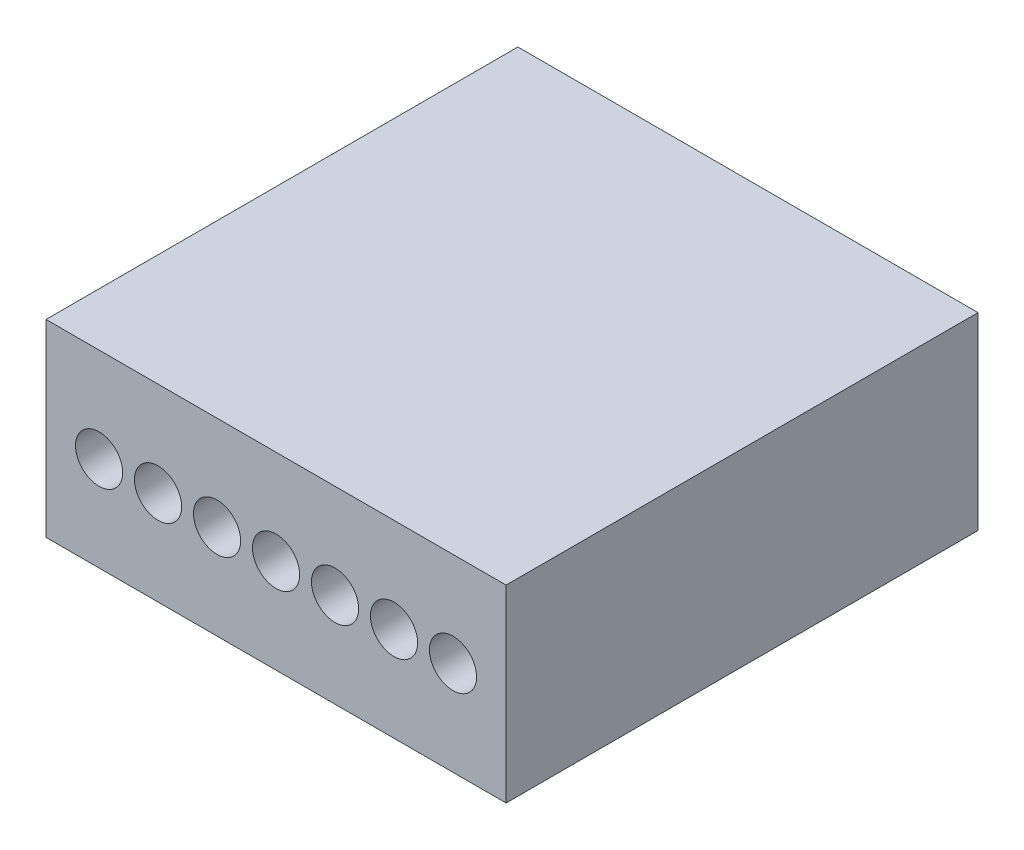
ISO-10303-21;
HEADER;
FILE_DESCRIPTION(('STEP AP214'),'2;1');
FILE_NAME('part.step','',(''),(''),'','','');
FILE_SCHEMA(('AUTOMOTIVE_DESIGN { 1 0 10303 214 1 1 1 1 }'));
ENDSEC;
DATA;
#1=APPLICATION_CONTEXT('core data for automotive mechanical design processes');
#2=APPLICATION_PROTOCOL_DEFINITION('international standard','automotive_design',2000,#1);
#3=PRODUCT_CONTEXT('',#1,'mechanical');
#4=PRODUCT('Part','Part','',(#3));
#5=PRODUCT_RELATED_PRODUCT_CATEGORY('part','',(#4));
#6=PRODUCT_DEFINITION_FORMATION('','',#4);
#7=PRODUCT_DEFINITION_CONTEXT('part definition',#1,'design');
#8=PRODUCT_DEFINITION('design','',#6,#7);
#9=PRODUCT_DEFINITION_SHAPE('','',#8);
#10=(LENGTH_UNIT() NAMED_UNIT(*) SI_UNIT(.MILLI.,.METRE.));
#11=(NAMED_UNIT(*) PLANE_ANGLE_UNIT() SI_UNIT($,.RADIAN.));
#12=(NAMED_UNIT(*) SI_UNIT($,.STERADIAN.) SOLID_ANGLE_UNIT());
#13=UNCERTAINTY_MEASURE_WITH_UNIT(LENGTH_MEASURE(1.E-05),#10,'distance_accuracy_value','');
#14=(GEOMETRIC_REPRESENTATION_CONTEXT(3) GLOBAL_UNCERTAINTY_ASSIGNED_CONTEXT((#13)) GLOBAL_UNIT_ASSIGNED_CONTEXT((#10,
#11,#12)) REPRESENTATION_CONTEXT('',''));
#15=CARTESIAN_POINT('',(0.,0.,0.));
#16=DIRECTION('',(0.,0.,1.));
#17=DIRECTION('',(1.,0.,0.));
#18=AXIS2_PLACEMENT_3D('',#15,#16,#17);
#19=CARTESIAN_POINT('',(0.,0.,10.));
#20=DIRECTION('',(1.,0.,0.));
#21=DIRECTION('',(0.,0.,-1.));
#22=AXIS2_PLACEMENT_3D('',#19,#20,#21);
#23=PLANE('',#22);
#24=DIRECTION('',(0.,-1.,0.));
#25=VECTOR('',#24,1.);
#26=CARTESIAN_POINT('',(0.,0.,0.));
#27=LINE('',#26,#25);
#28=CARTESIAN_POINT('',(0.,4.,0.));
#29=VERTEX_POINT('',#28);
#30=CARTESIAN_POINT('',(0.,0.,0.));
#31=VERTEX_POINT('',#30);
#32=EDGE_CURVE('E99',#29,#31,#27,.T.);
#33=ORIENTED_EDGE('',*,*,#32,.T.);
#34=DIRECTION('',(0.,0.,-1.));
#35=VECTOR('',#34,1.);
#36=CARTESIAN_POINT('',(0.,0.,10.));
#37=LINE('',#36,#35);
#38=CARTESIAN_POINT('',(0.,0.,10.));
#39=VERTEX_POINT('',#38);
#40=EDGE_CURVE('E11',#39,#31,#37,.T.);
#41=ORIENTED_EDGE('',*,*,#40,.F.);
#42=DIRECTION('',(0.,-1.,0.));
#43=VECTOR('',#42,1.);
#44=CARTESIAN_POINT('',(0.,0.,10.));
#45=LINE('',#44,#43);
#46=CARTESIAN_POINT('',(0.,4.,10.));
#47=VERTEX_POINT('',#46);
#48=EDGE_CURVE('E87',#47,#39,#45,.T.);
#49=ORIENTED_EDGE('',*,*,#48,.F.);
#50=DIRECTION('',(0.,0.,-1.));
#51=VECTOR('',#50,1.);
#52=CARTESIAN_POINT('',(0.,4.,10.));
#53=LINE('',#52,#51);
#54=EDGE_CURVE('E95',#47,#29,#53,.T.);
#55=ORIENTED_EDGE('',*,*,#54,.T.);
#56=EDGE_LOOP('',(#33,#41,#49,#55));
#57=FACE_BOUND('',#56,.T.);
#58=ADVANCED_FACE('F36',(#57),#23,.F.);
#59=CARTESIAN_POINT('',(0.,0.,10.));
#60=DIRECTION('',(0.,1.,0.));
#61=DIRECTION('',(0.,0.,1.));
#62=AXIS2_PLACEMENT_3D('',#59,#60,#61);
#63=PLANE('',#62);
#64=DIRECTION('',(1.,0.,0.));
#65=VECTOR('',#64,1.);
#66=CARTESIAN_POINT('',(0.,0.,0.));
#67=LINE('',#66,#65);
#68=CARTESIAN_POINT('',(9.75,0.,0.));
#69=VERTEX_POINT('',#68);
#70=EDGE_CURVE('E91',#31,#69,#67,.T.);
#71=ORIENTED_EDGE('',*,*,#70,.T.);
#72=DIRECTION('',(0.,0.,-1.));
#73=VECTOR('',#72,1.);
#74=CARTESIAN_POINT('',(9.75,0.,10.));
#75=LINE('',#74,#73);
#76=CARTESIAN_POINT('',(9.75,0.,10.));
#77=VERTEX_POINT('',#76);
#78=EDGE_CURVE('E44',#77,#69,#75,.T.);
#79=ORIENTED_EDGE('',*,*,#78,.F.);
#80=DIRECTION('',(1.,0.,0.));
#81=VECTOR('',#80,1.);
#82=CARTESIAN_POINT('',(0.,0.,10.));
#83=LINE('',#82,#81);
#84=EDGE_CURVE('E82',#39,#77,#83,.T.);
#85=ORIENTED_EDGE('',*,*,#84,.F.);
#86=ORIENTED_EDGE('',*,*,#40,.T.);
#87=EDGE_LOOP('',(#71,#79,#85,#86));
#88=FACE_BOUND('',#87,.T.);
#89=ADVANCED_FACE('F90',(#88),#63,.F.);
#90=CARTESIAN_POINT('',(9.75,0.,10.));
#91=DIRECTION('',(-1.,0.,0.));
#92=DIRECTION('',(0.,0.,1.));
#93=AXIS2_PLACEMENT_3D('',#90,#91,#92);
#94=PLANE('',#93);
#95=DIRECTION('',(0.,1.,0.));
#96=VECTOR('',#95,1.);
#97=CARTESIAN_POINT('',(9.75,0.,0.));
#98=LINE('',#97,#96);
#99=CARTESIAN_POINT('',(9.75,4.,0.));
#100=VERTEX_POINT('',#99);
#101=EDGE_CURVE('E69',#69,#100,#98,.T.);
#102=ORIENTED_EDGE('',*,*,#101,.T.);
#103=DIRECTION('',(0.,0.,-1.));
#104=VECTOR('',#103,1.);
#105=CARTESIAN_POINT('',(9.75,4.,10.));
#106=LINE('',#105,#104);
#107=CARTESIAN_POINT('',(9.75,4.,10.));
#108=VERTEX_POINT('',#107);
#109=EDGE_CURVE('E92',#108,#100,#106,.T.);
#110=ORIENTED_EDGE('',*,*,#109,.F.);
#111=DIRECTION('',(0.,1.,0.));
#112=VECTOR('',#111,1.);
#113=CARTESIAN_POINT('',(9.75,0.,10.));
#114=LINE('',#113,#112);
#115=EDGE_CURVE('E85',#77,#108,#114,.T.);
#116=ORIENTED_EDGE('',*,*,#115,.F.);
#117=ORIENTED_EDGE('',*,*,#78,.T.);
#118=EDGE_LOOP('',(#102,#110,#116,#117));
#119=FACE_BOUND('',#118,.T.);
#120=ADVANCED_FACE('F93',(#119),#94,.F.);
#121=CARTESIAN_POINT('',(0.,4.,10.));
#122=DIRECTION('',(0.,-1.,0.));
#123=DIRECTION('',(0.,0.,-1.));
#124=AXIS2_PLACEMENT_3D('',#121,#122,#123);
#125=PLANE('',#124);
#126=DIRECTION('',(-1.,0.,0.));
#127=VECTOR('',#126,1.);
#128=CARTESIAN_POINT('',(0.,4.,0.));
#129=LINE('',#128,#127);
#130=EDGE_CURVE('E75',#100,#29,#129,.T.);
#131=ORIENTED_EDGE('',*,*,#130,.T.);
#132=ORIENTED_EDGE('',*,*,#54,.F.);
#133=DIRECTION('',(-1.,0.,0.));
#134=VECTOR('',#133,1.);
#135=CARTESIAN_POINT('',(0.,4.,10.));
#136=LINE('',#135,#134);
#137=EDGE_CURVE('E52',#108,#47,#136,.T.);
#138=ORIENTED_EDGE('',*,*,#137,.F.);
#139=ORIENTED_EDGE('',*,*,#109,.T.);
#140=EDGE_LOOP('',(#131,#132,#138,#139));
#141=FACE_BOUND('',#140,.T.);
#142=ADVANCED_FACE('F107',(#141),#125,.F.);
#143=CARTESIAN_POINT('',(0.,0.,10.));
#144=DIRECTION('',(0.,0.,-1.));
#145=DIRECTION('',(-1.,0.,0.));
#146=AXIS2_PLACEMENT_3D('',#143,#144,#145);
#147=PLANE('',#146);
#148=CARTESIAN_POINT('',(1.125,2.,10.));
#149=DIRECTION('',(0.,0.,1.));
#150=DIRECTION('',(1.,0.,0.));
#151=AXIS2_PLACEMENT_3D('',#148,#149,#150);
#152=CIRCLE('',#151,0.5);
#153=CARTESIAN_POINT('',(1.625,2.,10.));
#154=VERTEX_POINT('',#153);
#155=EDGE_CURVE('E149',#154,#154,#152,.T.);
#156=ORIENTED_EDGE('',*,*,#155,.F.);
#157=EDGE_LOOP('',(#156));
#158=FACE_BOUND('',#157,.T.);
#159=CARTESIAN_POINT('',(2.375,2.,10.));
#160=DIRECTION('',(0.,0.,1.));
#161=DIRECTION('',(1.,0.,0.));
#162=AXIS2_PLACEMENT_3D('',#159,#160,#161);
#163=CIRCLE('',#162,0.5);
#164=CARTESIAN_POINT('',(2.875,2.,10.));
#165=VERTEX_POINT('',#164);
#166=EDGE_CURVE('E143',#165,#165,#163,.T.);
#167=ORIENTED_EDGE('',*,*,#166,.F.);
#168=EDGE_LOOP('',(#167));
#169=FACE_BOUND('',#168,.T.);
#170=CARTESIAN_POINT('',(3.625,2.,10.));
#171=DIRECTION('',(0.,0.,1.));
#172=DIRECTION('',(1.,0.,0.));
#173=AXIS2_PLACEMENT_3D('',#170,#171,#172);
#174=CIRCLE('',#173,0.5);
#175=CARTESIAN_POINT('',(4.125,2.,10.));
#176=VERTEX_POINT('',#175);
#177=EDGE_CURVE('E137',#176,#176,#174,.T.);
#178=ORIENTED_EDGE('',*,*,#177,.F.);
#179=EDGE_LOOP('',(#178));
#180=FACE_BOUND('',#179,.T.);
#181=CARTESIAN_POINT('',(4.875,2.,10.));
#182=DIRECTION('',(0.,0.,1.));
#183=DIRECTION('',(1.,0.,0.));
#184=AXIS2_PLACEMENT_3D('',#181,#182,#183);
#185=CIRCLE('',#184,0.5);
#186=CARTESIAN_POINT('',(5.375,2.,10.));
#187=VERTEX_POINT('',#186);
#188=EDGE_CURVE('E131',#187,#187,#185,.T.);
#189=ORIENTED_EDGE('',*,*,#188,.F.);
#190=EDGE_LOOP('',(#189));
#191=FACE_BOUND('',#190,.T.);
#192=CARTESIAN_POINT('',(6.125,2.,10.));
#193=DIRECTION('',(0.,0.,1.));
#194=DIRECTION('',(1.,0.,0.));
#195=AXIS2_PLACEMENT_3D('',#192,#193,#194);
#196=CIRCLE('',#195,0.5);
#197=CARTESIAN_POINT('',(6.625,2.,10.));
#198=VERTEX_POINT('',#197);
#199=EDGE_CURVE('E125',#198,#198,#196,.T.);
#200=ORIENTED_EDGE('',*,*,#199,.F.);
#201=EDGE_LOOP('',(#200));
#202=FACE_BOUND('',#201,.T.);
#203=CARTESIAN_POINT('',(7.375,2.,10.));
#204=DIRECTION('',(0.,0.,1.));
#205=DIRECTION('',(1.,0.,0.));
#206=AXIS2_PLACEMENT_3D('',#203,#204,#205);
#207=CIRCLE('',#206,0.500000000000002);
#208=CARTESIAN_POINT('',(7.875,2.,10.));
#209=VERTEX_POINT('',#208);
#210=EDGE_CURVE('E119',#209,#209,#207,.T.);
#211=ORIENTED_EDGE('',*,*,#210,.F.);
#212=EDGE_LOOP('',(#211));
#213=FACE_BOUND('',#212,.T.);
#214=CARTESIAN_POINT('',(8.625,2.,10.));
#215=DIRECTION('',(0.,0.,1.));
#216=DIRECTION('',(1.,0.,0.));
#217=AXIS2_PLACEMENT_3D('',#214,#215,#216);
#218=CIRCLE('',#217,0.499999999999999);
#219=CARTESIAN_POINT('',(9.125,2.,10.));
#220=VERTEX_POINT('',#219);
#221=EDGE_CURVE('E113',#220,#220,#218,.T.);
#222=ORIENTED_EDGE('',*,*,#221,.F.);
#223=EDGE_LOOP('',(#222));
#224=FACE_BOUND('',#223,.T.);
#225=ORIENTED_EDGE('',*,*,#48,.T.);
#226=ORIENTED_EDGE('',*,*,#84,.T.);
#227=ORIENTED_EDGE('',*,*,#115,.T.);
#228=ORIENTED_EDGE('',*,*,#137,.T.);
#229=EDGE_LOOP('',(#225,#226,#227,#228));
#230=FACE_BOUND('',#229,.T.);
#231=ADVANCED_FACE('F83',(#158,#169,#180,#191,#202,#213,#224,#230),#147,.F.);
#232=CARTESIAN_POINT('',(0.,0.,0.));
#233=DIRECTION('',(0.,0.,-1.));
#234=DIRECTION('',(-1.,0.,0.));
#235=AXIS2_PLACEMENT_3D('',#232,#233,#234);
#236=PLANE('',#235);
#237=ORIENTED_EDGE('',*,*,#32,.F.);
#238=ORIENTED_EDGE('',*,*,#130,.F.);
#239=ORIENTED_EDGE('',*,*,#101,.F.);
#240=ORIENTED_EDGE('',*,*,#70,.F.);
#241=EDGE_LOOP('',(#237,#238,#239,#240));
#242=FACE_BOUND('',#241,.T.);
#243=ADVANCED_FACE('F110',(#242),#236,.T.);
#244=CARTESIAN_POINT('',(8.625,2.,5.));
#245=DIRECTION('',(0.,0.,1.));
#246=DIRECTION('',(1.,0.,0.));
#247=AXIS2_PLACEMENT_3D('',#244,#245,#246);
#248=CYLINDRICAL_SURFACE('',#247,0.499999999999999);
#249=CARTESIAN_POINT('',(8.625,2.,5.));
#250=DIRECTION('',(0.,0.,1.));
#251=DIRECTION('',(1.,0.,0.));
#252=AXIS2_PLACEMENT_3D('',#249,#250,#251);
#253=CIRCLE('',#252,0.499999999999999);
#254=CARTESIAN_POINT('',(9.125,2.,5.));
#255=VERTEX_POINT('',#254);
#256=EDGE_CURVE('E116',#255,#255,#253,.T.);
#257=ORIENTED_EDGE('',*,*,#256,.F.);
#258=EDGE_LOOP('',(#257));
#259=FACE_BOUND('',#258,.T.);
#260=ORIENTED_EDGE('',*,*,#221,.T.);
#261=EDGE_LOOP('',(#260));
#262=FACE_BOUND('',#261,.T.);
#263=ADVANCED_FACE('F179',(#259,#262),#248,.F.);
#264=CARTESIAN_POINT('',(8.625,2.,5.));
#265=DIRECTION('',(0.,0.,1.));
#266=DIRECTION('',(1.,0.,0.));
#267=AXIS2_PLACEMENT_3D('',#264,#265,#266);
#268=PLANE('',#267);
#269=ORIENTED_EDGE('',*,*,#256,.T.);
#270=EDGE_LOOP('',(#269));
#271=FACE_BOUND('',#270,.T.);
#272=ADVANCED_FACE('F181',(#271),#268,.T.);
#273=CARTESIAN_POINT('',(7.375,2.,5.));
#274=DIRECTION('',(0.,0.,1.));
#275=DIRECTION('',(1.,0.,0.));
#276=AXIS2_PLACEMENT_3D('',#273,#274,#275);
#277=CYLINDRICAL_SURFACE('',#276,0.500000000000002);
#278=CARTESIAN_POINT('',(7.375,2.,5.));
#279=DIRECTION('',(0.,0.,1.));
#280=DIRECTION('',(1.,0.,0.));
#281=AXIS2_PLACEMENT_3D('',#278,#279,#280);
#282=CIRCLE('',#281,0.500000000000002);
#283=CARTESIAN_POINT('',(7.875,2.,5.));
#284=VERTEX_POINT('',#283);
#285=EDGE_CURVE('E122',#284,#284,#282,.T.);
#286=ORIENTED_EDGE('',*,*,#285,.F.);
#287=EDGE_LOOP('',(#286));
#288=FACE_BOUND('',#287,.T.);
#289=ORIENTED_EDGE('',*,*,#210,.T.);
#290=EDGE_LOOP('',(#289));
#291=FACE_BOUND('',#290,.T.);
#292=ADVANCED_FACE('F188',(#288,#291),#277,.F.);
#293=CARTESIAN_POINT('',(7.375,2.,5.));
#294=DIRECTION('',(0.,0.,1.));
#295=DIRECTION('',(1.,0.,0.));
#296=AXIS2_PLACEMENT_3D('',#293,#294,#295);
#297=PLANE('',#296);
#298=ORIENTED_EDGE('',*,*,#285,.T.);
#299=EDGE_LOOP('',(#298));
#300=FACE_BOUND('',#299,.T.);
#301=ADVANCED_FACE('F236',(#300),#297,.T.);
#302=CARTESIAN_POINT('',(6.125,2.,5.));
#303=DIRECTION('',(0.,0.,1.));
#304=DIRECTION('',(1.,0.,0.));
#305=AXIS2_PLACEMENT_3D('',#302,#303,#304);
#306=CYLINDRICAL_SURFACE('',#305,0.5);
#307=CARTESIAN_POINT('',(6.125,2.,5.));
#308=DIRECTION('',(0.,0.,1.));
#309=DIRECTION('',(1.,0.,0.));
#310=AXIS2_PLACEMENT_3D('',#307,#308,#309);
#311=CIRCLE('',#310,0.5);
#312=CARTESIAN_POINT('',(6.625,2.,5.));
#313=VERTEX_POINT('',#312);
#314=EDGE_CURVE('E128',#313,#313,#311,.T.);
#315=ORIENTED_EDGE('',*,*,#314,.F.);
#316=EDGE_LOOP('',(#315));
#317=FACE_BOUND('',#316,.T.);
#318=ORIENTED_EDGE('',*,*,#199,.T.);
#319=EDGE_LOOP('',(#318));
#320=FACE_BOUND('',#319,.T.);
#321=ADVANCED_FACE('F245',(#317,#320),#306,.F.);
#322=CARTESIAN_POINT('',(6.125,2.,5.));
#323=DIRECTION('',(0.,0.,1.));
#324=DIRECTION('',(1.,0.,0.));
#325=AXIS2_PLACEMENT_3D('',#322,#323,#324);
#326=PLANE('',#325);
#327=ORIENTED_EDGE('',*,*,#314,.T.);
#328=EDGE_LOOP('',(#327));
#329=FACE_BOUND('',#328,.T.);
#330=ADVANCED_FACE('F254',(#329),#326,.T.);
#331=CARTESIAN_POINT('',(4.875,2.,5.));
#332=DIRECTION('',(0.,0.,1.));
#333=DIRECTION('',(1.,0.,0.));
#334=AXIS2_PLACEMENT_3D('',#331,#332,#333);
#335=CYLINDRICAL_SURFACE('',#334,0.5);
#336=CARTESIAN_POINT('',(4.875,2.,5.));
#337=DIRECTION('',(0.,0.,1.));
#338=DIRECTION('',(1.,0.,0.));
#339=AXIS2_PLACEMENT_3D('',#336,#337,#338);
#340=CIRCLE('',#339,0.5);
#341=CARTESIAN_POINT('',(5.375,2.,5.));
#342=VERTEX_POINT('',#341);
#343=EDGE_CURVE('E134',#342,#342,#340,.T.);
#344=ORIENTED_EDGE('',*,*,#343,.F.);
#345=EDGE_LOOP('',(#344));
#346=FACE_BOUND('',#345,.T.);
#347=ORIENTED_EDGE('',*,*,#188,.T.);
#348=EDGE_LOOP('',(#347));
#349=FACE_BOUND('',#348,.T.);
#350=ADVANCED_FACE('F263',(#346,#349),#335,.F.);
#351=CARTESIAN_POINT('',(4.875,2.,5.));
#352=DIRECTION('',(0.,0.,1.));
#353=DIRECTION('',(1.,0.,0.));
#354=AXIS2_PLACEMENT_3D('',#351,#352,#353);
#355=PLANE('',#354);
#356=ORIENTED_EDGE('',*,*,#343,.T.);
#357=EDGE_LOOP('',(#356));
#358=FACE_BOUND('',#357,.T.);
#359=ADVANCED_FACE('F272',(#358),#355,.T.);
#360=CARTESIAN_POINT('',(3.625,2.,5.));
#361=DIRECTION('',(0.,0.,1.));
#362=DIRECTION('',(1.,0.,0.));
#363=AXIS2_PLACEMENT_3D('',#360,#361,#362);
#364=CYLINDRICAL_SURFACE('',#363,0.5);
#365=CARTESIAN_POINT('',(3.625,2.,5.));
#366=DIRECTION('',(0.,0.,1.));
#367=DIRECTION('',(1.,0.,0.));
#368=AXIS2_PLACEMENT_3D('',#365,#366,#367);
#369=CIRCLE('',#368,0.5);
#370=CARTESIAN_POINT('',(4.125,2.,5.));
#371=VERTEX_POINT('',#370);
#372=EDGE_CURVE('E140',#371,#371,#369,.T.);
#373=ORIENTED_EDGE('',*,*,#372,.F.);
#374=EDGE_LOOP('',(#373));
#375=FACE_BOUND('',#374,.T.);
#376=ORIENTED_EDGE('',*,*,#177,.T.);
#377=EDGE_LOOP('',(#376));
#378=FACE_BOUND('',#377,.T.);
#379=ADVANCED_FACE('F281',(#375,#378),#364,.F.);
#380=CARTESIAN_POINT('',(3.625,2.,5.));
#381=DIRECTION('',(0.,0.,1.));
#382=DIRECTION('',(1.,0.,0.));
#383=AXIS2_PLACEMENT_3D('',#380,#381,#382);
#384=PLANE('',#383);
#385=ORIENTED_EDGE('',*,*,#372,.T.);
#386=EDGE_LOOP('',(#385));
#387=FACE_BOUND('',#386,.T.);
#388=ADVANCED_FACE('F290',(#387),#384,.T.);
#389=CARTESIAN_POINT('',(2.375,2.,5.));
#390=DIRECTION('',(0.,0.,1.));
#391=DIRECTION('',(1.,0.,0.));
#392=AXIS2_PLACEMENT_3D('',#389,#390,#391);
#393=CYLINDRICAL_SURFACE('',#392,0.5);
#394=CARTESIAN_POINT('',(2.375,2.,5.));
#395=DIRECTION('',(0.,0.,1.));
#396=DIRECTION('',(1.,0.,0.));
#397=AXIS2_PLACEMENT_3D('',#394,#395,#396);
#398=CIRCLE('',#397,0.5);
#399=CARTESIAN_POINT('',(2.875,2.,5.));
#400=VERTEX_POINT('',#399);
#401=EDGE_CURVE('E146',#400,#400,#398,.T.);
#402=ORIENTED_EDGE('',*,*,#401,.F.);
#403=EDGE_LOOP('',(#402));
#404=FACE_BOUND('',#403,.T.);
#405=ORIENTED_EDGE('',*,*,#166,.T.);
#406=EDGE_LOOP('',(#405));
#407=FACE_BOUND('',#406,.T.);
#408=ADVANCED_FACE('F299',(#404,#407),#393,.F.);
#409=CARTESIAN_POINT('',(2.375,2.,5.));
#410=DIRECTION('',(0.,0.,1.));
#411=DIRECTION('',(1.,0.,0.));
#412=AXIS2_PLACEMENT_3D('',#409,#410,#411);
#413=PLANE('',#412);
#414=ORIENTED_EDGE('',*,*,#401,.T.);
#415=EDGE_LOOP('',(#414));
#416=FACE_BOUND('',#415,.T.);
#417=ADVANCED_FACE('F160',(#416),#413,.T.);
#418=CARTESIAN_POINT('',(1.125,2.,5.));
#419=DIRECTION('',(0.,0.,1.));
#420=DIRECTION('',(1.,0.,0.));
#421=AXIS2_PLACEMENT_3D('',#418,#419,#420);
#422=CYLINDRICAL_SURFACE('',#421,0.5);
#423=CARTESIAN_POINT('',(1.125,2.,5.));
#424=DIRECTION('',(0.,0.,1.));
#425=DIRECTION('',(1.,0.,0.));
#426=AXIS2_PLACEMENT_3D('',#423,#424,#425);
#427=CIRCLE('',#426,0.5);
#428=CARTESIAN_POINT('',(1.625,2.,5.));
#429=VERTEX_POINT('',#428);
#430=EDGE_CURVE('E102',#429,#429,#427,.T.);
#431=ORIENTED_EDGE('',*,*,#430,.F.);
#432=EDGE_LOOP('',(#431));
#433=FACE_BOUND('',#432,.T.);
#434=ORIENTED_EDGE('',*,*,#155,.T.);
#435=EDGE_LOOP('',(#434));
#436=FACE_BOUND('',#435,.T.);
#437=ADVANCED_FACE('F157',(#433,#436),#422,.F.);
#438=CARTESIAN_POINT('',(1.125,2.,5.));
#439=DIRECTION('',(0.,0.,1.));
#440=DIRECTION('',(1.,0.,0.));
#441=AXIS2_PLACEMENT_3D('',#438,#439,#440);
#442=PLANE('',#441);
#443=ORIENTED_EDGE('',*,*,#430,.T.);
#444=EDGE_LOOP('',(#443));
#445=FACE_BOUND('',#444,.T.);
#446=ADVANCED_FACE('F155',(#445),#442,.T.);
#447=CLOSED_SHELL('',(#58,#89,#120,#142,#231,#243,#263,#272,#292,#301,#321,#330,#350,#359,#379,
#388,#408,#417,#437,#446));
#448=MANIFOLD_SOLID_BREP('B2',#447);
#449=ADVANCED_BREP_SHAPE_REPRESENTATION('',(#18,#448),#14);
#450=SHAPE_DEFINITION_REPRESENTATION(#9,#449);
ENDSEC;
END-ISO-10303-21;
